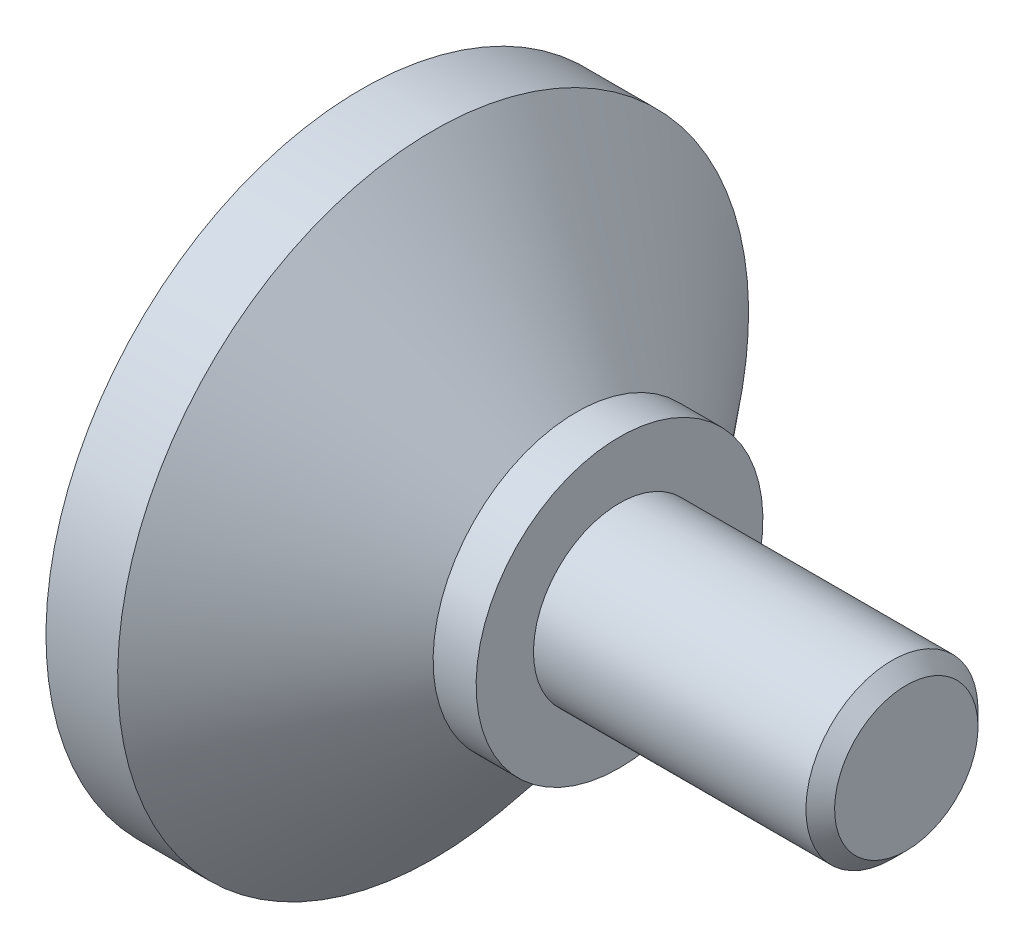
ISO-10303-21;
HEADER;
FILE_DESCRIPTION(('STEP AP214'),'2;1');
FILE_NAME('part.step','',(''),(''),'','','');
FILE_SCHEMA(('AUTOMOTIVE_DESIGN { 1 0 10303 214 1 1 1 1 }'));
ENDSEC;
DATA;
#1=APPLICATION_CONTEXT('core data for automotive mechanical design processes');
#2=APPLICATION_PROTOCOL_DEFINITION('international standard','automotive_design',2000,#1);
#3=PRODUCT_CONTEXT('',#1,'mechanical');
#4=PRODUCT('Part','Part','',(#3));
#5=PRODUCT_RELATED_PRODUCT_CATEGORY('part','',(#4));
#6=PRODUCT_DEFINITION_FORMATION('','',#4);
#7=PRODUCT_DEFINITION_CONTEXT('part definition',#1,'design');
#8=PRODUCT_DEFINITION('design','',#6,#7);
#9=PRODUCT_DEFINITION_SHAPE('','',#8);
#10=(LENGTH_UNIT() NAMED_UNIT(*) SI_UNIT(.MILLI.,.METRE.));
#11=(NAMED_UNIT(*) PLANE_ANGLE_UNIT() SI_UNIT($,.RADIAN.));
#12=(NAMED_UNIT(*) SI_UNIT($,.STERADIAN.) SOLID_ANGLE_UNIT());
#13=UNCERTAINTY_MEASURE_WITH_UNIT(LENGTH_MEASURE(1.E-05),#10,'distance_accuracy_value','');
#14=(GEOMETRIC_REPRESENTATION_CONTEXT(3) GLOBAL_UNCERTAINTY_ASSIGNED_CONTEXT((#13)) GLOBAL_UNIT_ASSIGNED_CONTEXT((#10,
#11,#12)) REPRESENTATION_CONTEXT('',''));
#15=CARTESIAN_POINT('',(0.,0.,0.));
#16=DIRECTION('',(0.,0.,1.));
#17=DIRECTION('',(1.,0.,0.));
#18=AXIS2_PLACEMENT_3D('',#15,#16,#17);
#19=CARTESIAN_POINT('',(0.,0.,0.));
#20=DIRECTION('',(-1.,0.,0.));
#21=DIRECTION('',(0.,-1.,0.));
#22=AXIS2_PLACEMENT_3D('',#19,#20,#21);
#23=PLANE('',#22);
#24=CARTESIAN_POINT('',(0.,0.,0.));
#25=DIRECTION('',(-1.,0.,0.));
#26=DIRECTION('',(0.,-1.,0.));
#27=AXIS2_PLACEMENT_3D('',#24,#25,#26);
#28=CIRCLE('',#27,2.5);
#29=CARTESIAN_POINT('',(0.,-2.5,0.));
#30=VERTEX_POINT('',#29);
#31=EDGE_CURVE('E10',#30,#30,#28,.F.);
#32=ORIENTED_EDGE('',*,*,#31,.T.);
#33=EDGE_LOOP('',(#32));
#34=FACE_BOUND('',#33,.T.);
#35=ADVANCED_FACE('F39',(#34),#23,.F.);
#36=CARTESIAN_POINT('',(-19.,0.,0.));
#37=DIRECTION('',(-1.,0.,0.));
#38=DIRECTION('',(0.,-1.,0.));
#39=AXIS2_PLACEMENT_3D('',#36,#37,#38);
#40=CYLINDRICAL_SURFACE('',#39,3.);
#41=CARTESIAN_POINT('',(-0.499999999999987,0.,0.));
#42=DIRECTION('',(-1.,0.,0.));
#43=DIRECTION('',(0.,-1.,0.));
#44=AXIS2_PLACEMENT_3D('',#41,#42,#43);
#45=CIRCLE('',#44,3.);
#46=CARTESIAN_POINT('',(-0.499999999999986,-2.99999999999999,0.));
#47=VERTEX_POINT('',#46);
#48=EDGE_CURVE('E46',#47,#47,#45,.T.);
#49=ORIENTED_EDGE('',*,*,#48,.T.);
#50=EDGE_LOOP('',(#49));
#51=FACE_BOUND('',#50,.T.);
#52=CARTESIAN_POINT('',(-10.,0.,0.));
#53=DIRECTION('',(-1.,0.,0.));
#54=DIRECTION('',(0.,-1.,0.));
#55=AXIS2_PLACEMENT_3D('',#52,#53,#54);
#56=CIRCLE('',#55,3.);
#57=CARTESIAN_POINT('',(-10.,-3.,0.));
#58=VERTEX_POINT('',#57);
#59=EDGE_CURVE('E50',#58,#58,#56,.T.);
#60=ORIENTED_EDGE('',*,*,#59,.F.);
#61=EDGE_LOOP('',(#60));
#62=FACE_BOUND('',#61,.T.);
#63=ADVANCED_FACE('F92',(#51,#62),#40,.T.);
#64=CARTESIAN_POINT('',(-10.,3.,0.));
#65=DIRECTION('',(-1.,0.,0.));
#66=DIRECTION('',(0.,-1.,0.));
#67=AXIS2_PLACEMENT_3D('',#64,#65,#66);
#68=PLANE('',#67);
#69=CARTESIAN_POINT('',(-10.,0.,0.));
#70=DIRECTION('',(-1.,0.,0.));
#71=DIRECTION('',(0.,-1.,0.));
#72=AXIS2_PLACEMENT_3D('',#69,#70,#71);
#73=CIRCLE('',#72,5.);
#74=CARTESIAN_POINT('',(-10.,-5.,0.));
#75=VERTEX_POINT('',#74);
#76=EDGE_CURVE('E54',#75,#75,#73,.T.);
#77=ORIENTED_EDGE('',*,*,#76,.F.);
#78=EDGE_LOOP('',(#77));
#79=FACE_BOUND('',#78,.T.);
#80=ORIENTED_EDGE('',*,*,#59,.T.);
#81=EDGE_LOOP('',(#80));
#82=FACE_BOUND('',#81,.T.);
#83=ADVANCED_FACE('F86',(#79,#82),#68,.F.);
#84=CARTESIAN_POINT('',(-19.,0.,0.));
#85=DIRECTION('',(-1.,0.,0.));
#86=DIRECTION('',(0.,-1.,0.));
#87=AXIS2_PLACEMENT_3D('',#84,#85,#86);
#88=CYLINDRICAL_SURFACE('',#87,5.);
#89=CARTESIAN_POINT('',(-11.5,0.,0.));
#90=DIRECTION('',(-1.,0.,0.));
#91=DIRECTION('',(0.,-1.,0.));
#92=AXIS2_PLACEMENT_3D('',#89,#90,#91);
#93=CIRCLE('',#92,5.);
#94=CARTESIAN_POINT('',(-11.5,-5.,0.));
#95=VERTEX_POINT('',#94);
#96=EDGE_CURVE('E59',#95,#95,#93,.T.);
#97=ORIENTED_EDGE('',*,*,#96,.F.);
#98=EDGE_LOOP('',(#97));
#99=FACE_BOUND('',#98,.T.);
#100=ORIENTED_EDGE('',*,*,#76,.T.);
#101=EDGE_LOOP('',(#100));
#102=FACE_BOUND('',#101,.T.);
#103=ADVANCED_FACE('F80',(#99,#102),#88,.T.);
#104=CARTESIAN_POINT('',(-11.5,0.,0.));
#105=DIRECTION('',(-1.,0.,0.));
#106=DIRECTION('',(0.,-1.,0.));
#107=AXIS2_PLACEMENT_3D('',#104,#105,#106);
#108=CONICAL_SURFACE('',#107,5.,0.876058050598194);
#109=CARTESIAN_POINT('',(-16.5,0.,0.));
#110=DIRECTION('',(-1.,0.,0.));
#111=DIRECTION('',(0.,-1.,0.));
#112=AXIS2_PLACEMENT_3D('',#109,#110,#111);
#113=CIRCLE('',#112,11.);
#114=CARTESIAN_POINT('',(-16.5,-11.,0.));
#115=VERTEX_POINT('',#114);
#116=EDGE_CURVE('E62',#115,#115,#113,.T.);
#117=ORIENTED_EDGE('',*,*,#116,.F.);
#118=EDGE_LOOP('',(#117));
#119=FACE_BOUND('',#118,.T.);
#120=ORIENTED_EDGE('',*,*,#96,.T.);
#121=EDGE_LOOP('',(#120));
#122=FACE_BOUND('',#121,.T.);
#123=ADVANCED_FACE('F74',(#119,#122),#108,.T.);
#124=CARTESIAN_POINT('',(-19.,0.,0.));
#125=DIRECTION('',(-1.,0.,0.));
#126=DIRECTION('',(0.,-1.,0.));
#127=AXIS2_PLACEMENT_3D('',#124,#125,#126);
#128=CYLINDRICAL_SURFACE('',#127,11.);
#129=CARTESIAN_POINT('',(-19.,0.,0.));
#130=DIRECTION('',(-1.,0.,0.));
#131=DIRECTION('',(0.,-1.,0.));
#132=AXIS2_PLACEMENT_3D('',#129,#130,#131);
#133=CIRCLE('',#132,11.);
#134=CARTESIAN_POINT('',(-19.,-11.,0.));
#135=VERTEX_POINT('',#134);
#136=EDGE_CURVE('E65',#135,#135,#133,.T.);
#137=ORIENTED_EDGE('',*,*,#136,.F.);
#138=EDGE_LOOP('',(#137));
#139=FACE_BOUND('',#138,.T.);
#140=ORIENTED_EDGE('',*,*,#116,.T.);
#141=EDGE_LOOP('',(#140));
#142=FACE_BOUND('',#141,.T.);
#143=ADVANCED_FACE('F71',(#139,#142),#128,.T.);
#144=CARTESIAN_POINT('',(-19.,11.,0.));
#145=DIRECTION('',(1.,0.,0.));
#146=DIRECTION('',(0.,1.,0.));
#147=AXIS2_PLACEMENT_3D('',#144,#145,#146);
#148=PLANE('',#147);
#149=ORIENTED_EDGE('',*,*,#136,.T.);
#150=EDGE_LOOP('',(#149));
#151=FACE_BOUND('',#150,.T.);
#152=ADVANCED_FACE('F69',(#151),#148,.F.);
#153=CARTESIAN_POINT('',(-0.499999999999987,0.,0.));
#154=DIRECTION('',(-1.,0.,0.));
#155=DIRECTION('',(0.,-1.,0.));
#156=AXIS2_PLACEMENT_3D('',#153,#154,#155);
#157=CONICAL_SURFACE('',#156,3.,0.785398163397453);
#158=ORIENTED_EDGE('',*,*,#31,.F.);
#159=EDGE_LOOP('',(#158));
#160=FACE_BOUND('',#159,.T.);
#161=ORIENTED_EDGE('',*,*,#48,.F.);
#162=EDGE_LOOP('',(#161));
#163=FACE_BOUND('',#162,.T.);
#164=ADVANCED_FACE('F41',(#160,#163),#157,.T.);
#165=CLOSED_SHELL('',(#35,#63,#83,#103,#123,#143,#152,#164));
#166=MANIFOLD_SOLID_BREP('B2',#165);
#167=ADVANCED_BREP_SHAPE_REPRESENTATION('',(#18,#166),#14);
#168=SHAPE_DEFINITION_REPRESENTATION(#9,#167);
ENDSEC;
END-ISO-10303-21;
